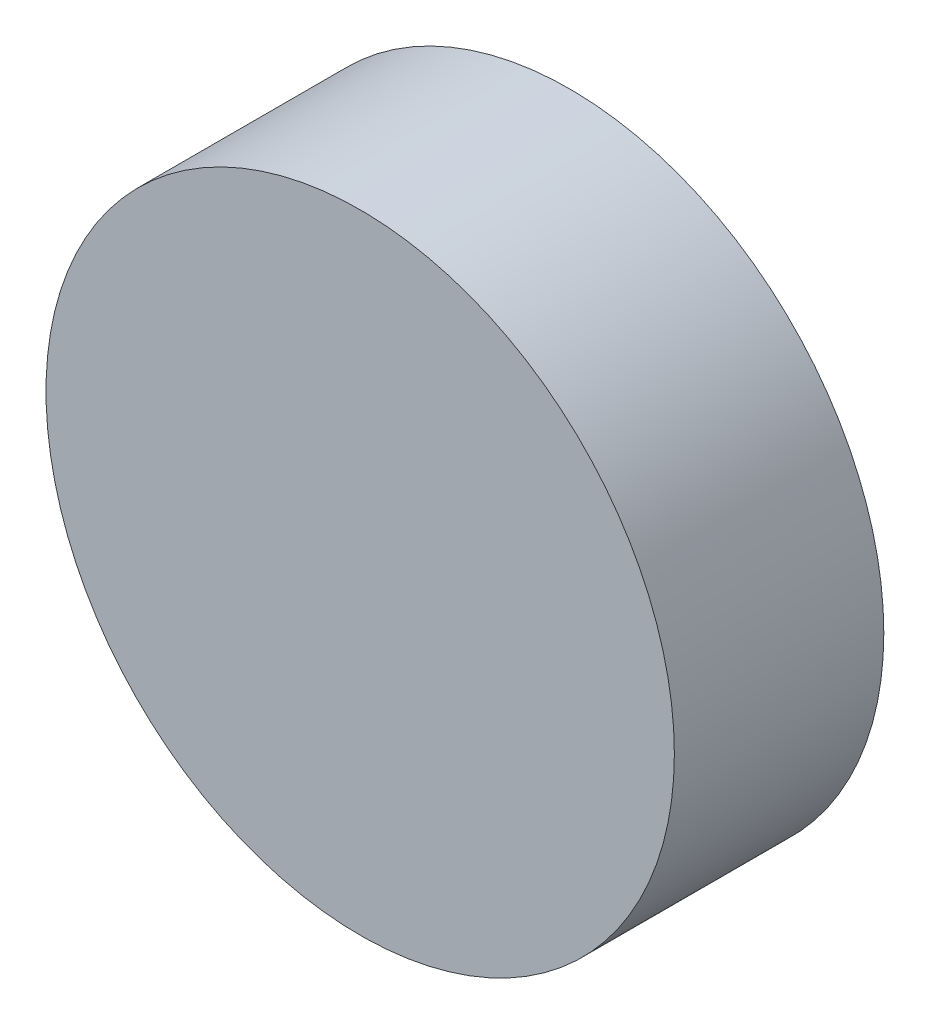
ISO-10303-21;
HEADER;
FILE_DESCRIPTION(('STEP AP214'),'2;1');
FILE_NAME('part.step','',(''),(''),'','','');
FILE_SCHEMA(('AUTOMOTIVE_DESIGN { 1 0 10303 214 1 1 1 1 }'));
ENDSEC;
DATA;
#1=APPLICATION_CONTEXT('core data for automotive mechanical design processes');
#2=APPLICATION_PROTOCOL_DEFINITION('international standard','automotive_design',2000,#1);
#3=PRODUCT_CONTEXT('',#1,'mechanical');
#4=PRODUCT('Part','Part','',(#3));
#5=PRODUCT_RELATED_PRODUCT_CATEGORY('part','',(#4));
#6=PRODUCT_DEFINITION_FORMATION('','',#4);
#7=PRODUCT_DEFINITION_CONTEXT('part definition',#1,'design');
#8=PRODUCT_DEFINITION('design','',#6,#7);
#9=PRODUCT_DEFINITION_SHAPE('','',#8);
#10=(LENGTH_UNIT() NAMED_UNIT(*) SI_UNIT(.MILLI.,.METRE.));
#11=(NAMED_UNIT(*) PLANE_ANGLE_UNIT() SI_UNIT($,.RADIAN.));
#12=(NAMED_UNIT(*) SI_UNIT($,.STERADIAN.) SOLID_ANGLE_UNIT());
#13=UNCERTAINTY_MEASURE_WITH_UNIT(LENGTH_MEASURE(1.E-05),#10,'distance_accuracy_value','');
#14=(GEOMETRIC_REPRESENTATION_CONTEXT(3) GLOBAL_UNCERTAINTY_ASSIGNED_CONTEXT((#13)) GLOBAL_UNIT_ASSIGNED_CONTEXT((#10,
#11,#12)) REPRESENTATION_CONTEXT('',''));
#15=CARTESIAN_POINT('',(0.,0.,0.));
#16=DIRECTION('',(0.,0.,1.));
#17=DIRECTION('',(1.,0.,0.));
#18=AXIS2_PLACEMENT_3D('',#15,#16,#17);
#19=CARTESIAN_POINT('',(0.,0.,50.8));
#20=DIRECTION('',(0.,0.,-1.));
#21=DIRECTION('',(-1.,0.,0.));
#22=AXIS2_PLACEMENT_3D('',#19,#20,#21);
#23=CYLINDRICAL_SURFACE('',#22,152.4);
#24=CARTESIAN_POINT('',(0.,0.,50.8));
#25=DIRECTION('',(0.,0.,1.));
#26=DIRECTION('',(1.,0.,0.));
#27=AXIS2_PLACEMENT_3D('',#24,#25,#26);
#28=CIRCLE('',#27,152.4);
#29=CARTESIAN_POINT('',(152.4,0.,50.8));
#30=VERTEX_POINT('',#29);
#31=EDGE_CURVE('E10',#30,#30,#28,.T.);
#32=ORIENTED_EDGE('',*,*,#31,.F.);
#33=EDGE_LOOP('',(#32));
#34=FACE_BOUND('',#33,.T.);
#35=CARTESIAN_POINT('',(0.,0.,-50.8));
#36=DIRECTION('',(0.,0.,1.));
#37=DIRECTION('',(1.,0.,0.));
#38=AXIS2_PLACEMENT_3D('',#35,#36,#37);
#39=CIRCLE('',#38,152.4);
#40=CARTESIAN_POINT('',(152.4,0.,-50.8));
#41=VERTEX_POINT('',#40);
#42=EDGE_CURVE('E39',#41,#41,#39,.T.);
#43=ORIENTED_EDGE('',*,*,#42,.T.);
#44=EDGE_LOOP('',(#43));
#45=FACE_BOUND('',#44,.T.);
#46=ADVANCED_FACE('F36',(#34,#45),#23,.T.);
#47=CARTESIAN_POINT('',(0.,0.,50.8));
#48=DIRECTION('',(0.,0.,1.));
#49=DIRECTION('',(1.,0.,0.));
#50=AXIS2_PLACEMENT_3D('',#47,#48,#49);
#51=PLANE('',#50);
#52=ORIENTED_EDGE('',*,*,#31,.T.);
#53=EDGE_LOOP('',(#52));
#54=FACE_BOUND('',#53,.T.);
#55=ADVANCED_FACE('F51',(#54),#51,.T.);
#56=CARTESIAN_POINT('',(0.,0.,-50.8));
#57=DIRECTION('',(0.,0.,1.));
#58=DIRECTION('',(1.,0.,0.));
#59=AXIS2_PLACEMENT_3D('',#56,#57,#58);
#60=PLANE('',#59);
#61=ORIENTED_EDGE('',*,*,#42,.F.);
#62=EDGE_LOOP('',(#61));
#63=FACE_BOUND('',#62,.T.);
#64=ADVANCED_FACE('F49',(#63),#60,.F.);
#65=CLOSED_SHELL('',(#46,#55,#64));
#66=MANIFOLD_SOLID_BREP('B2',#65);
#67=ADVANCED_BREP_SHAPE_REPRESENTATION('',(#18,#66),#14);
#68=SHAPE_DEFINITION_REPRESENTATION(#9,#67);
ENDSEC;
END-ISO-10303-21;
